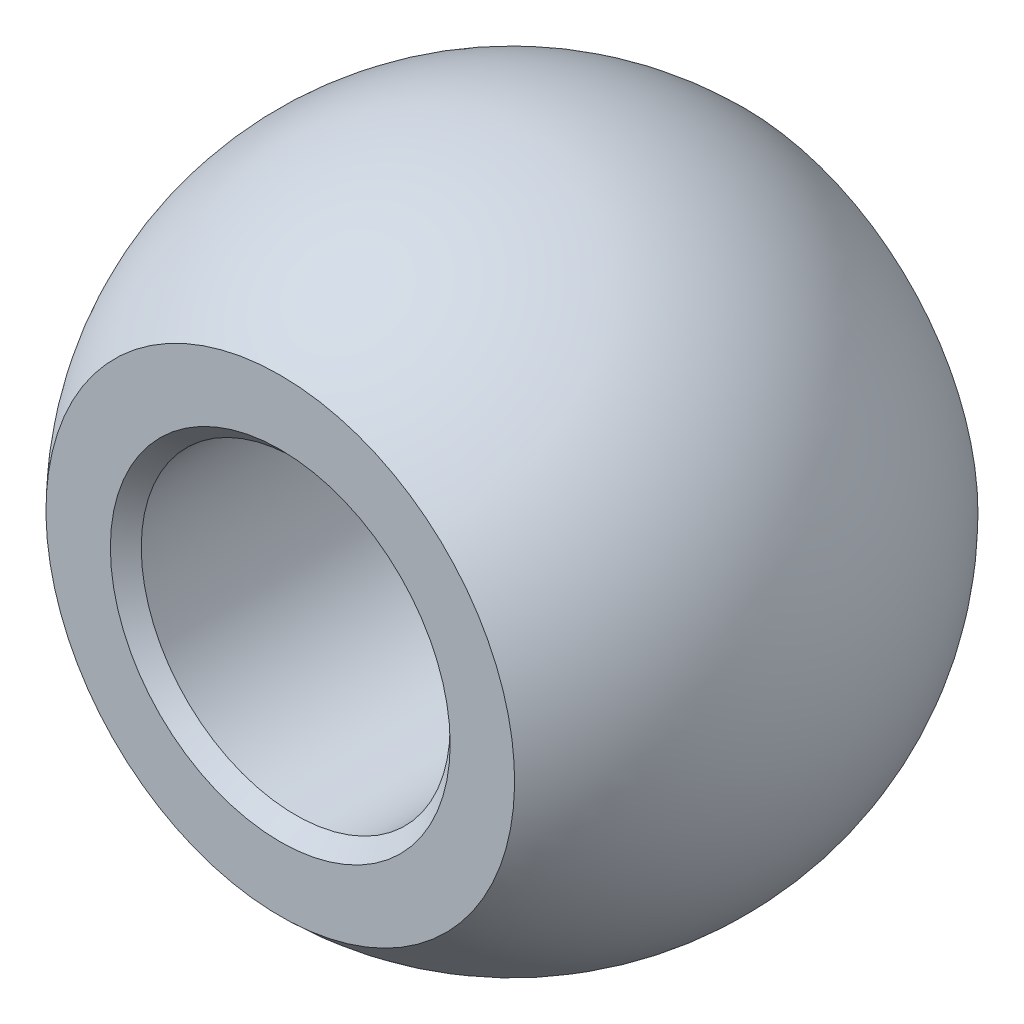
ISO-10303-21;
HEADER;
FILE_DESCRIPTION(('STEP AP214'),'2;1');
FILE_NAME('part.step','',(''),(''),'','','');
FILE_SCHEMA(('AUTOMOTIVE_DESIGN { 1 0 10303 214 1 1 1 1 }'));
ENDSEC;
DATA;
#1=APPLICATION_CONTEXT('core data for automotive mechanical design processes');
#2=APPLICATION_PROTOCOL_DEFINITION('international standard','automotive_design',2000,#1);
#3=PRODUCT_CONTEXT('',#1,'mechanical');
#4=PRODUCT('Part','Part','',(#3));
#5=PRODUCT_RELATED_PRODUCT_CATEGORY('part','',(#4));
#6=PRODUCT_DEFINITION_FORMATION('','',#4);
#7=PRODUCT_DEFINITION_CONTEXT('part definition',#1,'design');
#8=PRODUCT_DEFINITION('design','',#6,#7);
#9=PRODUCT_DEFINITION_SHAPE('','',#8);
#10=(LENGTH_UNIT() NAMED_UNIT(*) SI_UNIT(.MILLI.,.METRE.));
#11=(NAMED_UNIT(*) PLANE_ANGLE_UNIT() SI_UNIT($,.RADIAN.));
#12=(NAMED_UNIT(*) SI_UNIT($,.STERADIAN.) SOLID_ANGLE_UNIT());
#13=UNCERTAINTY_MEASURE_WITH_UNIT(LENGTH_MEASURE(1.E-05),#10,'distance_accuracy_value','');
#14=(GEOMETRIC_REPRESENTATION_CONTEXT(3) GLOBAL_UNCERTAINTY_ASSIGNED_CONTEXT((#13)) GLOBAL_UNIT_ASSIGNED_CONTEXT((#10,
#11,#12)) REPRESENTATION_CONTEXT('',''));
#15=CARTESIAN_POINT('',(0.,0.,0.));
#16=DIRECTION('',(0.,0.,1.));
#17=DIRECTION('',(1.,0.,0.));
#18=AXIS2_PLACEMENT_3D('',#15,#16,#17);
#19=CARTESIAN_POINT('',(0.,0.,0.));
#20=DIRECTION('',(0.,1.,0.));
#21=DIRECTION('',(1.,0.,0.));
#22=AXIS2_PLACEMENT_3D('',#19,#20,#21);
#23=SPHERICAL_SURFACE('',#22,6.4);
#24=CARTESIAN_POINT('',(0.,0.,0.));
#25=DIRECTION('',(0.,0.,-1.));
#26=DIRECTION('',(0.,1.,0.));
#27=AXIS2_PLACEMENT_3D('',#24,#25,#26);
#28=SPHERICAL_SURFACE('',#27,6.4);
#29=CARTESIAN_POINT('',(0.,0.,4.5));
#30=DIRECTION('',(0.,0.,-1.));
#31=DIRECTION('',(0.,1.,0.));
#32=AXIS2_PLACEMENT_3D('',#29,#30,#31);
#33=CIRCLE('',#32,4.5508241011931);
#34=CARTESIAN_POINT('',(0.,4.5508241011931,4.5));
#35=VERTEX_POINT('',#34);
#36=EDGE_CURVE('E55',#35,#35,#33,.F.);
#37=ORIENTED_EDGE('',*,*,#36,.F.);
#38=EDGE_LOOP('',(#37));
#39=FACE_BOUND('',#38,.T.);
#40=CARTESIAN_POINT('',(0.,0.,-4.5));
#41=DIRECTION('',(0.,0.,1.));
#42=DIRECTION('',(0.,-1.,0.));
#43=AXIS2_PLACEMENT_3D('',#40,#41,#42);
#44=CIRCLE('',#43,4.5508241011931);
#45=CARTESIAN_POINT('',(0.,-4.5508241011931,-4.5));
#46=VERTEX_POINT('',#45);
#47=EDGE_CURVE('E54',#46,#46,#44,.F.);
#48=ORIENTED_EDGE('',*,*,#47,.F.);
#49=EDGE_LOOP('',(#48));
#50=FACE_BOUND('',#49,.T.);
#51=ADVANCED_FACE('F34',(#39,#50),#28,.T.);
#52=CARTESIAN_POINT('',(-6.4,7.90827763743701,-4.5));
#53=DIRECTION('',(0.,0.,1.));
#54=DIRECTION('',(0.,-1.,0.));
#55=AXIS2_PLACEMENT_3D('',#52,#53,#54);
#56=PLANE('',#55);
#57=CARTESIAN_POINT('',(0.,0.,-4.5));
#58=DIRECTION('',(0.,0.,1.));
#59=DIRECTION('',(0.,-1.,0.));
#60=AXIS2_PLACEMENT_3D('',#57,#58,#59);
#61=CIRCLE('',#60,3.3);
#62=CARTESIAN_POINT('',(0.,-3.3,-4.5));
#63=VERTEX_POINT('',#62);
#64=EDGE_CURVE('E10',#63,#63,#61,.T.);
#65=ORIENTED_EDGE('',*,*,#64,.T.);
#66=EDGE_LOOP('',(#65));
#67=FACE_BOUND('',#66,.T.);
#68=ORIENTED_EDGE('',*,*,#47,.T.);
#69=EDGE_LOOP('',(#68));
#70=FACE_BOUND('',#69,.T.);
#71=ADVANCED_FACE('F61',(#67,#70),#56,.F.);
#72=CARTESIAN_POINT('',(-6.4,8.45041359442809,4.5));
#73=DIRECTION('',(0.,0.,-1.));
#74=DIRECTION('',(0.,1.,0.));
#75=AXIS2_PLACEMENT_3D('',#72,#73,#74);
#76=PLANE('',#75);
#77=CARTESIAN_POINT('',(0.,0.,4.5));
#78=DIRECTION('',(0.,0.,-1.));
#79=DIRECTION('',(0.,1.,0.));
#80=AXIS2_PLACEMENT_3D('',#77,#78,#79);
#81=CIRCLE('',#80,3.3);
#82=CARTESIAN_POINT('',(0.,3.3,4.5));
#83=VERTEX_POINT('',#82);
#84=EDGE_CURVE('E41',#83,#83,#81,.T.);
#85=ORIENTED_EDGE('',*,*,#84,.T.);
#86=EDGE_LOOP('',(#85));
#87=FACE_BOUND('',#86,.T.);
#88=ORIENTED_EDGE('',*,*,#36,.T.);
#89=EDGE_LOOP('',(#88));
#90=FACE_BOUND('',#89,.T.);
#91=ADVANCED_FACE('F69',(#87,#90),#76,.F.);
#92=CARTESIAN_POINT('',(0.,0.,-4.5));
#93=DIRECTION('',(0.,0.,1.));
#94=DIRECTION('',(1.,0.,0.));
#95=AXIS2_PLACEMENT_3D('',#92,#93,#94);
#96=CYLINDRICAL_SURFACE('',#95,3.);
#97=CARTESIAN_POINT('',(0.,0.,4.2));
#98=DIRECTION('',(0.,0.,-1.));
#99=DIRECTION('',(-1.,0.,0.));
#100=AXIS2_PLACEMENT_3D('',#97,#98,#99);
#101=CIRCLE('',#100,3.);
#102=CARTESIAN_POINT('',(-3.,0.,4.2));
#103=VERTEX_POINT('',#102);
#104=EDGE_CURVE('E45',#103,#103,#101,.F.);
#105=ORIENTED_EDGE('',*,*,#104,.T.);
#106=EDGE_LOOP('',(#105));
#107=FACE_BOUND('',#106,.T.);
#108=CARTESIAN_POINT('',(0.,0.,-4.2));
#109=DIRECTION('',(0.,0.,1.));
#110=DIRECTION('',(1.,0.,0.));
#111=AXIS2_PLACEMENT_3D('',#108,#109,#110);
#112=CIRCLE('',#111,3.);
#113=CARTESIAN_POINT('',(3.,0.,-4.2));
#114=VERTEX_POINT('',#113);
#115=EDGE_CURVE('E49',#114,#114,#112,.F.);
#116=ORIENTED_EDGE('',*,*,#115,.T.);
#117=EDGE_LOOP('',(#116));
#118=FACE_BOUND('',#117,.T.);
#119=ADVANCED_FACE('F75',(#107,#118),#96,.F.);
#120=CARTESIAN_POINT('',(0.,0.,4.2));
#121=DIRECTION('',(0.,0.,1.));
#122=DIRECTION('',(1.,0.,0.));
#123=AXIS2_PLACEMENT_3D('',#120,#121,#122);
#124=CONICAL_SURFACE('',#123,3.,0.785398163397457);
#125=ORIENTED_EDGE('',*,*,#84,.F.);
#126=EDGE_LOOP('',(#125));
#127=FACE_BOUND('',#126,.T.);
#128=ORIENTED_EDGE('',*,*,#104,.F.);
#129=EDGE_LOOP('',(#128));
#130=FACE_BOUND('',#129,.T.);
#131=ADVANCED_FACE('F73',(#127,#130),#124,.F.);
#132=CARTESIAN_POINT('',(0.,0.,-4.5));
#133=DIRECTION('',(0.,0.,-1.));
#134=DIRECTION('',(-1.,0.,0.));
#135=AXIS2_PLACEMENT_3D('',#132,#133,#134);
#136=CONICAL_SURFACE('',#135,3.3,0.785398163397445);
#137=ORIENTED_EDGE('',*,*,#115,.F.);
#138=EDGE_LOOP('',(#137));
#139=FACE_BOUND('',#138,.T.);
#140=ORIENTED_EDGE('',*,*,#64,.F.);
#141=EDGE_LOOP('',(#140));
#142=FACE_BOUND('',#141,.T.);
#143=ADVANCED_FACE('F36',(#139,#142),#136,.F.);
#144=CLOSED_SHELL('',(#51,#71,#91,#119,#131,#143));
#145=MANIFOLD_SOLID_BREP('B2',#144);
#146=ADVANCED_BREP_SHAPE_REPRESENTATION('',(#18,#145),#14);
#147=SHAPE_DEFINITION_REPRESENTATION(#9,#146);
ENDSEC;
END-ISO-10303-21;
